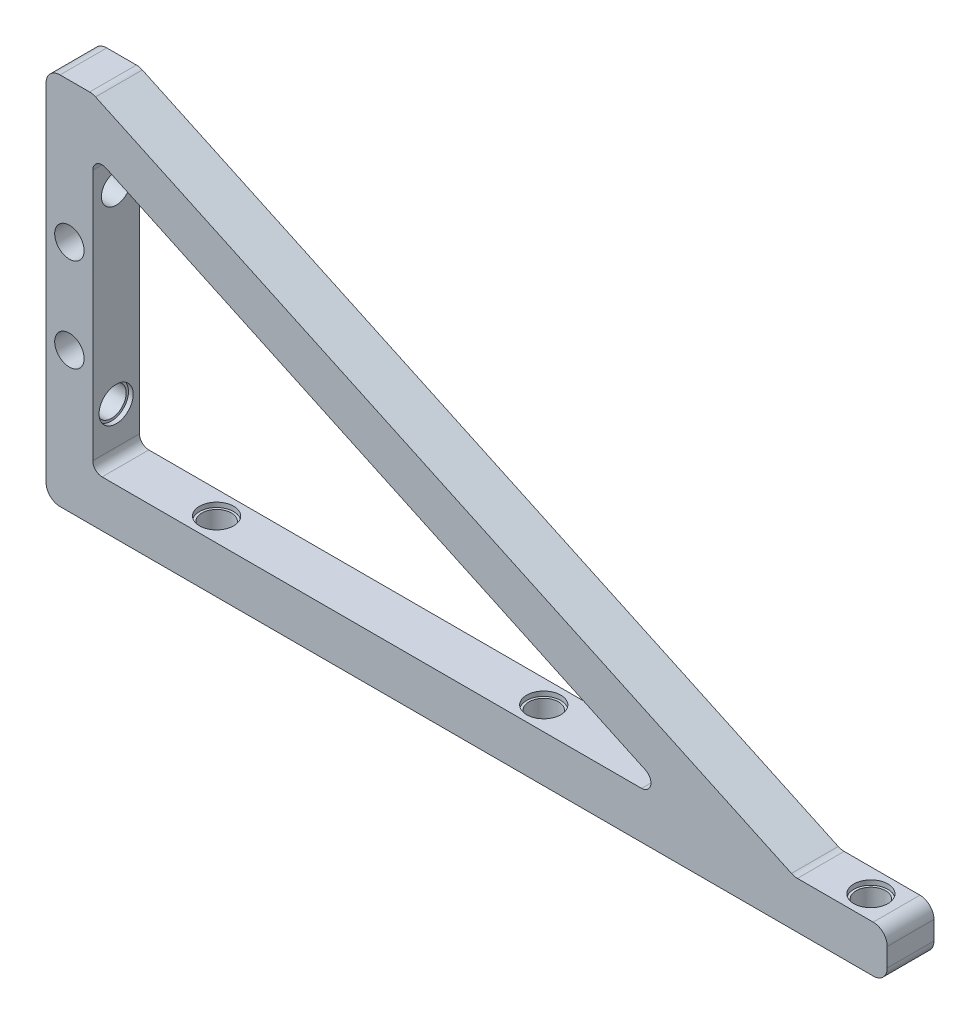
ISO-10303-21;
HEADER;
FILE_DESCRIPTION(('STEP AP214'),'2;1');
FILE_NAME('part.step','',(''),(''),'','','');
FILE_SCHEMA(('AUTOMOTIVE_DESIGN { 1 0 10303 214 1 1 1 1 }'));
ENDSEC;
DATA;
#1=APPLICATION_CONTEXT('core data for automotive mechanical design processes');
#2=APPLICATION_PROTOCOL_DEFINITION('international standard','automotive_design',2000,#1);
#3=PRODUCT_CONTEXT('',#1,'mechanical');
#4=PRODUCT('Part','Part','',(#3));
#5=PRODUCT_RELATED_PRODUCT_CATEGORY('part','',(#4));
#6=PRODUCT_DEFINITION_FORMATION('','',#4);
#7=PRODUCT_DEFINITION_CONTEXT('part definition',#1,'design');
#8=PRODUCT_DEFINITION('design','',#6,#7);
#9=PRODUCT_DEFINITION_SHAPE('','',#8);
#10=(LENGTH_UNIT() NAMED_UNIT(*) SI_UNIT(.MILLI.,.METRE.));
#11=(NAMED_UNIT(*) PLANE_ANGLE_UNIT() SI_UNIT($,.RADIAN.));
#12=(NAMED_UNIT(*) SI_UNIT($,.STERADIAN.) SOLID_ANGLE_UNIT());
#13=UNCERTAINTY_MEASURE_WITH_UNIT(LENGTH_MEASURE(1.E-05),#10,'distance_accuracy_value','');
#14=(GEOMETRIC_REPRESENTATION_CONTEXT(3) GLOBAL_UNCERTAINTY_ASSIGNED_CONTEXT((#13)) GLOBAL_UNIT_ASSIGNED_CONTEXT((#10,
#11,#12)) REPRESENTATION_CONTEXT('',''));
#15=CARTESIAN_POINT('',(0.,0.,0.));
#16=DIRECTION('',(0.,0.,1.));
#17=DIRECTION('',(1.,0.,0.));
#18=AXIS2_PLACEMENT_3D('',#15,#16,#17);
#19=CARTESIAN_POINT('',(5.,30.,0.));
#20=DIRECTION('',(0.,0.,1.));
#21=DIRECTION('',(1.,0.,0.));
#22=AXIS2_PLACEMENT_3D('',#19,#20,#21);
#23=CYLINDRICAL_SURFACE('',#22,3.15);
#24=CARTESIAN_POINT('',(5.,30.,10.));
#25=DIRECTION('',(0.,0.,-1.));
#26=DIRECTION('',(-1.,0.,0.));
#27=AXIS2_PLACEMENT_3D('',#24,#25,#26);
#28=CIRCLE('',#27,3.15);
#29=CARTESIAN_POINT('',(1.85000000000001,30.,10.));
#30=VERTEX_POINT('',#29);
#31=EDGE_CURVE('E264',#30,#30,#28,.T.);
#32=ORIENTED_EDGE('',*,*,#31,.F.);
#33=EDGE_LOOP('',(#32));
#34=FACE_BOUND('',#33,.T.);
#35=CARTESIAN_POINT('',(5.,30.,1.));
#36=DIRECTION('',(0.,0.,-1.));
#37=DIRECTION('',(-1.,0.,0.));
#38=AXIS2_PLACEMENT_3D('',#35,#36,#37);
#39=CIRCLE('',#38,3.15);
#40=CARTESIAN_POINT('',(1.85000000000001,30.,1.));
#41=VERTEX_POINT('',#40);
#42=EDGE_CURVE('E37',#41,#41,#39,.F.);
#43=ORIENTED_EDGE('',*,*,#42,.F.);
#44=EDGE_LOOP('',(#43));
#45=FACE_BOUND('',#44,.T.);
#46=ADVANCED_FACE('F33',(#34,#45),#23,.F.);
#47=CARTESIAN_POINT('',(5.,50.,0.));
#48=DIRECTION('',(0.,0.,1.));
#49=DIRECTION('',(1.,0.,0.));
#50=AXIS2_PLACEMENT_3D('',#47,#48,#49);
#51=CYLINDRICAL_SURFACE('',#50,3.15);
#52=CARTESIAN_POINT('',(5.,50.,10.));
#53=DIRECTION('',(0.,0.,-1.));
#54=DIRECTION('',(-1.,0.,0.));
#55=AXIS2_PLACEMENT_3D('',#52,#53,#54);
#56=CIRCLE('',#55,3.15);
#57=CARTESIAN_POINT('',(1.85000000000001,50.,10.));
#58=VERTEX_POINT('',#57);
#59=EDGE_CURVE('E269',#58,#58,#56,.T.);
#60=ORIENTED_EDGE('',*,*,#59,.F.);
#61=EDGE_LOOP('',(#60));
#62=FACE_BOUND('',#61,.T.);
#63=CARTESIAN_POINT('',(5.,50.,1.));
#64=DIRECTION('',(0.,0.,-1.));
#65=DIRECTION('',(-1.,0.,0.));
#66=AXIS2_PLACEMENT_3D('',#63,#64,#65);
#67=CIRCLE('',#66,3.15);
#68=CARTESIAN_POINT('',(1.85000000000001,50.,1.));
#69=VERTEX_POINT('',#68);
#70=EDGE_CURVE('E262',#69,#69,#67,.F.);
#71=ORIENTED_EDGE('',*,*,#70,.F.);
#72=EDGE_LOOP('',(#71));
#73=FACE_BOUND('',#72,.T.);
#74=ADVANCED_FACE('F457',(#62,#73),#51,.F.);
#75=CARTESIAN_POINT('',(-1.2E-05,20.,5.));
#76=DIRECTION('',(1.,0.,0.));
#77=DIRECTION('',(0.,0.,-1.));
#78=AXIS2_PLACEMENT_3D('',#75,#76,#77);
#79=CYLINDRICAL_SURFACE('',#78,3.15);
#80=CARTESIAN_POINT('',(0.,20.,5.));
#81=DIRECTION('',(1.,0.,0.));
#82=DIRECTION('',(0.,0.,-1.));
#83=AXIS2_PLACEMENT_3D('',#80,#81,#82);
#84=CIRCLE('',#83,3.15);
#85=CARTESIAN_POINT('',(0.,20.,1.85));
#86=VERTEX_POINT('',#85);
#87=EDGE_CURVE('E297',#86,#86,#84,.F.);
#88=ORIENTED_EDGE('',*,*,#87,.T.);
#89=EDGE_LOOP('',(#88));
#90=FACE_BOUND('',#89,.T.);
#91=CARTESIAN_POINT('',(9.00000000000001,20.,5.));
#92=DIRECTION('',(1.,0.,0.));
#93=DIRECTION('',(0.,0.,-1.));
#94=AXIS2_PLACEMENT_3D('',#91,#92,#93);
#95=CIRCLE('',#94,3.15);
#96=CARTESIAN_POINT('',(9.00000000000001,20.,1.85));
#97=VERTEX_POINT('',#96);
#98=EDGE_CURVE('E196',#97,#97,#95,.T.);
#99=ORIENTED_EDGE('',*,*,#98,.T.);
#100=EDGE_LOOP('',(#99));
#101=FACE_BOUND('',#100,.T.);
#102=ADVANCED_FACE('F463',(#90,#101),#79,.F.);
#103=CARTESIAN_POINT('',(-1.2E-05,60.,5.));
#104=DIRECTION('',(1.,0.,0.));
#105=DIRECTION('',(0.,0.,-1.));
#106=AXIS2_PLACEMENT_3D('',#103,#104,#105);
#107=CYLINDRICAL_SURFACE('',#106,3.15);
#108=CARTESIAN_POINT('',(10.,60.,5.));
#109=DIRECTION('',(-1.,0.,0.));
#110=DIRECTION('',(0.,0.,1.));
#111=AXIS2_PLACEMENT_3D('',#108,#109,#110);
#112=CIRCLE('',#111,3.15);
#113=CARTESIAN_POINT('',(10.,60.,8.15));
#114=VERTEX_POINT('',#113);
#115=EDGE_CURVE('E300',#114,#114,#112,.F.);
#116=ORIENTED_EDGE('',*,*,#115,.T.);
#117=EDGE_LOOP('',(#116));
#118=FACE_BOUND('',#117,.T.);
#119=CARTESIAN_POINT('',(1.,60.,5.));
#120=DIRECTION('',(-1.,0.,0.));
#121=DIRECTION('',(0.,0.,1.));
#122=AXIS2_PLACEMENT_3D('',#119,#120,#121);
#123=CIRCLE('',#122,3.15);
#124=CARTESIAN_POINT('',(1.,60.,8.15));
#125=VERTEX_POINT('',#124);
#126=EDGE_CURVE('E293',#125,#125,#123,.T.);
#127=ORIENTED_EDGE('',*,*,#126,.T.);
#128=EDGE_LOOP('',(#127));
#129=FACE_BOUND('',#128,.T.);
#130=ADVANCED_FACE('F379',(#118,#129),#107,.F.);
#131=CARTESIAN_POINT('',(171.5,-1.2E-05,5.));
#132=DIRECTION('',(0.,1.,0.));
#133=DIRECTION('',(0.,0.,1.));
#134=AXIS2_PLACEMENT_3D('',#131,#132,#133);
#135=CYLINDRICAL_SURFACE('',#134,3.14999999999998);
#136=CARTESIAN_POINT('',(171.5,0.,5.));
#137=DIRECTION('',(0.,1.,0.));
#138=DIRECTION('',(0.,0.,1.));
#139=AXIS2_PLACEMENT_3D('',#136,#137,#138);
#140=CIRCLE('',#139,3.14999999999998);
#141=CARTESIAN_POINT('',(171.5,0.,8.14999999999999));
#142=VERTEX_POINT('',#141);
#143=EDGE_CURVE('E327',#142,#142,#140,.F.);
#144=ORIENTED_EDGE('',*,*,#143,.T.);
#145=EDGE_LOOP('',(#144));
#146=FACE_BOUND('',#145,.T.);
#147=CARTESIAN_POINT('',(171.5,9.,5.));
#148=DIRECTION('',(0.,1.,0.));
#149=DIRECTION('',(0.,0.,1.));
#150=AXIS2_PLACEMENT_3D('',#147,#148,#149);
#151=CIRCLE('',#150,3.14999999999998);
#152=CARTESIAN_POINT('',(171.5,9.,8.14999999999999));
#153=VERTEX_POINT('',#152);
#154=EDGE_CURVE('E307',#153,#153,#151,.T.);
#155=ORIENTED_EDGE('',*,*,#154,.T.);
#156=EDGE_LOOP('',(#155));
#157=FACE_BOUND('',#156,.T.);
#158=ADVANCED_FACE('F483',(#146,#157),#135,.F.);
#159=CARTESIAN_POINT('',(101.5,-1.2E-05,5.));
#160=DIRECTION('',(0.,1.,0.));
#161=DIRECTION('',(0.,0.,1.));
#162=AXIS2_PLACEMENT_3D('',#159,#160,#161);
#163=CYLINDRICAL_SURFACE('',#162,3.15000000000001);
#164=CARTESIAN_POINT('',(101.5,0.,5.));
#165=DIRECTION('',(0.,1.,0.));
#166=DIRECTION('',(0.,0.,1.));
#167=AXIS2_PLACEMENT_3D('',#164,#165,#166);
#168=CIRCLE('',#167,3.15000000000001);
#169=CARTESIAN_POINT('',(101.5,0.,8.15000000000001));
#170=VERTEX_POINT('',#169);
#171=EDGE_CURVE('E328',#170,#170,#168,.F.);
#172=ORIENTED_EDGE('',*,*,#171,.T.);
#173=EDGE_LOOP('',(#172));
#174=FACE_BOUND('',#173,.T.);
#175=CARTESIAN_POINT('',(101.5,9.,5.));
#176=DIRECTION('',(0.,1.,0.));
#177=DIRECTION('',(0.,0.,1.));
#178=AXIS2_PLACEMENT_3D('',#175,#176,#177);
#179=CIRCLE('',#178,3.15000000000001);
#180=CARTESIAN_POINT('',(101.5,9.,8.15000000000001));
#181=VERTEX_POINT('',#180);
#182=EDGE_CURVE('E319',#181,#181,#179,.T.);
#183=ORIENTED_EDGE('',*,*,#182,.T.);
#184=EDGE_LOOP('',(#183));
#185=FACE_BOUND('',#184,.T.);
#186=ADVANCED_FACE('F511',(#174,#185),#163,.F.);
#187=CARTESIAN_POINT('',(10.,10.,0.));
#188=DIRECTION('',(0.,-1.,0.));
#189=DIRECTION('',(0.,0.,-1.));
#190=AXIS2_PLACEMENT_3D('',#187,#188,#189);
#191=PLANE('',#190);
#192=CARTESIAN_POINT('',(171.5,10.,5.));
#193=DIRECTION('',(0.,1.,0.));
#194=DIRECTION('',(0.,0.,1.));
#195=AXIS2_PLACEMENT_3D('',#192,#193,#194);
#196=CIRCLE('',#195,3.64999999999998);
#197=CARTESIAN_POINT('',(171.5,10.,8.64999999999998));
#198=VERTEX_POINT('',#197);
#199=EDGE_CURVE('E308',#198,#198,#196,.T.);
#200=ORIENTED_EDGE('',*,*,#199,.F.);
#201=EDGE_LOOP('',(#200));
#202=FACE_BOUND('',#201,.T.);
#203=DIRECTION('',(1.,0.,0.));
#204=VECTOR('',#203,1.);
#205=CARTESIAN_POINT('',(10.,10.,0.));
#206=LINE('',#205,#204);
#207=CARTESIAN_POINT('',(160.780568423598,10.,0.));
#208=VERTEX_POINT('',#207);
#209=CARTESIAN_POINT('',(177.,10.,0.));
#210=VERTEX_POINT('',#209);
#211=EDGE_CURVE('E344',#208,#210,#206,.T.);
#212=ORIENTED_EDGE('',*,*,#211,.F.);
#213=DIRECTION('',(0.,0.,1.));
#214=VECTOR('',#213,1.);
#215=CARTESIAN_POINT('',(160.780568423598,10.,0.));
#216=LINE('',#215,#214);
#217=CARTESIAN_POINT('',(160.780568423598,10.,10.));
#218=VERTEX_POINT('',#217);
#219=EDGE_CURVE('E217',#208,#218,#216,.T.);
#220=ORIENTED_EDGE('',*,*,#219,.T.);
#221=DIRECTION('',(-1.,0.,0.));
#222=VECTOR('',#221,1.);
#223=CARTESIAN_POINT('',(0.,10.,10.));
#224=LINE('',#223,#222);
#225=CARTESIAN_POINT('',(177.,10.,10.));
#226=VERTEX_POINT('',#225);
#227=EDGE_CURVE('E183',#226,#218,#224,.T.);
#228=ORIENTED_EDGE('',*,*,#227,.F.);
#229=DIRECTION('',(0.,0.,1.));
#230=VECTOR('',#229,1.);
#231=CARTESIAN_POINT('',(177.,10.,0.));
#232=LINE('',#231,#230);
#233=EDGE_CURVE('E215',#226,#210,#232,.F.);
#234=ORIENTED_EDGE('',*,*,#233,.T.);
#235=EDGE_LOOP('',(#212,#220,#228,#234));
#236=FACE_BOUND('',#235,.T.);
#237=ADVANCED_FACE('F399',(#202,#236),#191,.F.);
#238=CARTESIAN_POINT('',(0.,0.,10.));
#239=DIRECTION('',(1.,0.,0.));
#240=DIRECTION('',(0.,0.,-1.));
#241=AXIS2_PLACEMENT_3D('',#238,#239,#240);
#242=PLANE('',#241);
#243=CARTESIAN_POINT('',(0.,60.,5.));
#244=DIRECTION('',(-1.,0.,0.));
#245=DIRECTION('',(0.,0.,1.));
#246=AXIS2_PLACEMENT_3D('',#243,#244,#245);
#247=CIRCLE('',#246,3.65);
#248=CARTESIAN_POINT('',(0.,60.,8.65));
#249=VERTEX_POINT('',#248);
#250=EDGE_CURVE('E294',#249,#249,#247,.T.);
#251=ORIENTED_EDGE('',*,*,#250,.F.);
#252=EDGE_LOOP('',(#251));
#253=FACE_BOUND('',#252,.T.);
#254=ORIENTED_EDGE('',*,*,#87,.F.);
#255=EDGE_LOOP('',(#254));
#256=FACE_BOUND('',#255,.T.);
#257=DIRECTION('',(0.,-1.,0.));
#258=VECTOR('',#257,1.);
#259=CARTESIAN_POINT('',(0.,0.,0.));
#260=LINE('',#259,#258);
#261=CARTESIAN_POINT('',(0.,77.,0.));
#262=VERTEX_POINT('',#261);
#263=CARTESIAN_POINT('',(0.,3.,0.));
#264=VERTEX_POINT('',#263);
#265=EDGE_CURVE('E350',#262,#264,#260,.T.);
#266=ORIENTED_EDGE('',*,*,#265,.T.);
#267=DIRECTION('',(0.,0.,-1.));
#268=VECTOR('',#267,1.);
#269=CARTESIAN_POINT('',(0.,3.,10.));
#270=LINE('',#269,#268);
#271=CARTESIAN_POINT('',(0.,3.,10.));
#272=VERTEX_POINT('',#271);
#273=EDGE_CURVE('E256',#264,#272,#270,.F.);
#274=ORIENTED_EDGE('',*,*,#273,.T.);
#275=DIRECTION('',(0.,-1.,0.));
#276=VECTOR('',#275,1.);
#277=CARTESIAN_POINT('',(0.,0.,10.));
#278=LINE('',#277,#276);
#279=CARTESIAN_POINT('',(0.,77.,10.));
#280=VERTEX_POINT('',#279);
#281=EDGE_CURVE('E351',#280,#272,#278,.T.);
#282=ORIENTED_EDGE('',*,*,#281,.F.);
#283=DIRECTION('',(0.,0.,-1.));
#284=VECTOR('',#283,1.);
#285=CARTESIAN_POINT('',(0.,77.,10.));
#286=LINE('',#285,#284);
#287=EDGE_CURVE('E254',#280,#262,#286,.T.);
#288=ORIENTED_EDGE('',*,*,#287,.T.);
#289=EDGE_LOOP('',(#266,#274,#282,#288));
#290=FACE_BOUND('',#289,.T.);
#291=ADVANCED_FACE('F395',(#253,#256,#290),#242,.F.);
#292=CARTESIAN_POINT('',(0.,0.,10.));
#293=DIRECTION('',(0.,1.,0.));
#294=DIRECTION('',(0.,0.,1.));
#295=AXIS2_PLACEMENT_3D('',#292,#293,#294);
#296=PLANE('',#295);
#297=ORIENTED_EDGE('',*,*,#143,.F.);
#298=EDGE_LOOP('',(#297));
#299=FACE_BOUND('',#298,.T.);
#300=CARTESIAN_POINT('',(31.5,0.,4.99999999999998));
#301=DIRECTION('',(0.,1.,0.));
#302=DIRECTION('',(0.,0.,1.));
#303=AXIS2_PLACEMENT_3D('',#300,#301,#302);
#304=CIRCLE('',#303,3.15000000000003);
#305=CARTESIAN_POINT('',(31.5,0.,8.15000000000001));
#306=VERTEX_POINT('',#305);
#307=EDGE_CURVE('E324',#306,#306,#304,.F.);
#308=ORIENTED_EDGE('',*,*,#307,.F.);
#309=EDGE_LOOP('',(#308));
#310=FACE_BOUND('',#309,.T.);
#311=ORIENTED_EDGE('',*,*,#171,.F.);
#312=EDGE_LOOP('',(#311));
#313=FACE_BOUND('',#312,.T.);
#314=DIRECTION('',(1.,0.,0.));
#315=VECTOR('',#314,1.);
#316=CARTESIAN_POINT('',(0.,0.,0.));
#317=LINE('',#316,#315);
#318=CARTESIAN_POINT('',(3.,0.,0.));
#319=VERTEX_POINT('',#318);
#320=CARTESIAN_POINT('',(177.,0.,0.));
#321=VERTEX_POINT('',#320);
#322=EDGE_CURVE('E361',#319,#321,#317,.T.);
#323=ORIENTED_EDGE('',*,*,#322,.T.);
#324=DIRECTION('',(0.,0.,-1.));
#325=VECTOR('',#324,1.);
#326=CARTESIAN_POINT('',(177.,0.,10.));
#327=LINE('',#326,#325);
#328=CARTESIAN_POINT('',(177.,0.,10.));
#329=VERTEX_POINT('',#328);
#330=EDGE_CURVE('E252',#321,#329,#327,.F.);
#331=ORIENTED_EDGE('',*,*,#330,.T.);
#332=DIRECTION('',(1.,0.,0.));
#333=VECTOR('',#332,1.);
#334=CARTESIAN_POINT('',(0.,0.,10.));
#335=LINE('',#334,#333);
#336=CARTESIAN_POINT('',(3.,0.,10.));
#337=VERTEX_POINT('',#336);
#338=EDGE_CURVE('E354',#337,#329,#335,.T.);
#339=ORIENTED_EDGE('',*,*,#338,.F.);
#340=DIRECTION('',(0.,0.,-1.));
#341=VECTOR('',#340,1.);
#342=CARTESIAN_POINT('',(3.,0.,10.));
#343=LINE('',#342,#341);
#344=EDGE_CURVE('E249',#337,#319,#343,.T.);
#345=ORIENTED_EDGE('',*,*,#344,.T.);
#346=EDGE_LOOP('',(#323,#331,#339,#345));
#347=FACE_BOUND('',#346,.T.);
#348=ADVANCED_FACE('F398',(#299,#310,#313,#347),#296,.F.);
#349=CARTESIAN_POINT('',(180.,0.,10.));
#350=DIRECTION('',(-1.,0.,0.));
#351=DIRECTION('',(0.,0.,1.));
#352=AXIS2_PLACEMENT_3D('',#349,#350,#351);
#353=PLANE('',#352);
#354=DIRECTION('',(0.,1.,0.));
#355=VECTOR('',#354,1.);
#356=CARTESIAN_POINT('',(180.,0.,0.));
#357=LINE('',#356,#355);
#358=CARTESIAN_POINT('',(180.,3.,0.));
#359=VERTEX_POINT('',#358);
#360=CARTESIAN_POINT('',(180.,7.,0.));
#361=VERTEX_POINT('',#360);
#362=EDGE_CURVE('E364',#359,#361,#357,.T.);
#363=ORIENTED_EDGE('',*,*,#362,.T.);
#364=DIRECTION('',(0.,0.,1.));
#365=VECTOR('',#364,1.);
#366=CARTESIAN_POINT('',(180.,7.,10.));
#367=LINE('',#366,#365);
#368=CARTESIAN_POINT('',(180.,7.,10.));
#369=VERTEX_POINT('',#368);
#370=EDGE_CURVE('E228',#361,#369,#367,.T.);
#371=ORIENTED_EDGE('',*,*,#370,.T.);
#372=DIRECTION('',(0.,1.,0.));
#373=VECTOR('',#372,1.);
#374=CARTESIAN_POINT('',(180.,0.,10.));
#375=LINE('',#374,#373);
#376=CARTESIAN_POINT('',(180.,3.,10.));
#377=VERTEX_POINT('',#376);
#378=EDGE_CURVE('E193',#377,#369,#375,.T.);
#379=ORIENTED_EDGE('',*,*,#378,.F.);
#380=DIRECTION('',(0.,0.,-1.));
#381=VECTOR('',#380,1.);
#382=CARTESIAN_POINT('',(180.,3.,10.));
#383=LINE('',#382,#381);
#384=EDGE_CURVE('E225',#377,#359,#383,.T.);
#385=ORIENTED_EDGE('',*,*,#384,.T.);
#386=EDGE_LOOP('',(#363,#371,#379,#385));
#387=FACE_BOUND('',#386,.T.);
#388=ADVANCED_FACE('F418',(#387),#353,.F.);
#389=CARTESIAN_POINT('',(0.,80.,10.));
#390=DIRECTION('',(0.,-1.,0.));
#391=DIRECTION('',(0.,0.,-1.));
#392=AXIS2_PLACEMENT_3D('',#389,#390,#391);
#393=PLANE('',#392);
#394=DIRECTION('',(-1.,0.,0.));
#395=VECTOR('',#394,1.);
#396=CARTESIAN_POINT('',(0.,80.,10.));
#397=LINE('',#396,#395);
#398=CARTESIAN_POINT('',(9.3349160120712,80.,10.));
#399=VERTEX_POINT('',#398);
#400=CARTESIAN_POINT('',(3.,80.,10.));
#401=VERTEX_POINT('',#400);
#402=EDGE_CURVE('E188',#399,#401,#397,.T.);
#403=ORIENTED_EDGE('',*,*,#402,.F.);
#404=DIRECTION('',(0.,0.,1.));
#405=VECTOR('',#404,1.);
#406=CARTESIAN_POINT('',(9.3349160120712,80.,0.));
#407=LINE('',#406,#405);
#408=CARTESIAN_POINT('',(9.3349160120712,80.,0.));
#409=VERTEX_POINT('',#408);
#410=EDGE_CURVE('E260',#399,#409,#407,.F.);
#411=ORIENTED_EDGE('',*,*,#410,.T.);
#412=DIRECTION('',(-1.,0.,0.));
#413=VECTOR('',#412,1.);
#414=CARTESIAN_POINT('',(0.,80.,0.));
#415=LINE('',#414,#413);
#416=CARTESIAN_POINT('',(3.,80.,0.));
#417=VERTEX_POINT('',#416);
#418=EDGE_CURVE('E355',#409,#417,#415,.T.);
#419=ORIENTED_EDGE('',*,*,#418,.T.);
#420=DIRECTION('',(0.,0.,-1.));
#421=VECTOR('',#420,1.);
#422=CARTESIAN_POINT('',(3.,80.,10.));
#423=LINE('',#422,#421);
#424=EDGE_CURVE('E258',#417,#401,#423,.F.);
#425=ORIENTED_EDGE('',*,*,#424,.T.);
#426=EDGE_LOOP('',(#403,#411,#419,#425));
#427=FACE_BOUND('',#426,.T.);
#428=ADVANCED_FACE('F446',(#427),#393,.F.);
#429=CARTESIAN_POINT('',(0.,0.,10.));
#430=DIRECTION('',(0.,0.,-1.));
#431=DIRECTION('',(-1.,0.,0.));
#432=AXIS2_PLACEMENT_3D('',#429,#430,#431);
#433=PLANE('',#432);
#434=ORIENTED_EDGE('',*,*,#31,.T.);
#435=EDGE_LOOP('',(#434));
#436=FACE_BOUND('',#435,.T.);
#437=ORIENTED_EDGE('',*,*,#59,.T.);
#438=EDGE_LOOP('',(#437));
#439=FACE_BOUND('',#438,.T.);
#440=CARTESIAN_POINT('',(127.43205159682,10.,10.));
#441=VERTEX_POINT('',#440);
#442=CARTESIAN_POINT('',(12.,10.,10.));
#443=VERTEX_POINT('',#442);
#444=EDGE_CURVE('E165',#441,#443,#224,.T.);
#445=ORIENTED_EDGE('',*,*,#444,.T.);
#446=CARTESIAN_POINT('',(12.,12.,10.));
#447=DIRECTION('',(0.,0.,-1.));
#448=DIRECTION('',(-1.,0.,0.));
#449=AXIS2_PLACEMENT_3D('',#446,#447,#448);
#450=CIRCLE('',#449,2.);
#451=CARTESIAN_POINT('',(10.,12.,10.));
#452=VERTEX_POINT('',#451);
#453=EDGE_CURVE('E207',#443,#452,#450,.T.);
#454=ORIENTED_EDGE('',*,*,#453,.T.);
#455=DIRECTION('',(0.,1.,0.));
#456=VECTOR('',#455,1.);
#457=CARTESIAN_POINT('',(10.,0.,10.));
#458=LINE('',#457,#456);
#459=CARTESIAN_POINT('',(10.,65.8268496561401,10.));
#460=VERTEX_POINT('',#459);
#461=EDGE_CURVE('E347',#452,#460,#458,.T.);
#462=ORIENTED_EDGE('',*,*,#461,.T.);
#463=CARTESIAN_POINT('',(12.,65.8268496561401,10.));
#464=DIRECTION('',(0.,0.,-1.));
#465=DIRECTION('',(-1.,0.,0.));
#466=AXIS2_PLACEMENT_3D('',#463,#464,#465);
#467=CIRCLE('',#466,2.);
#468=CARTESIAN_POINT('',(12.8452365234814,67.6394652302134,10.));
#469=VERTEX_POINT('',#468);
#470=EDGE_CURVE('E211',#460,#469,#467,.T.);
#471=ORIENTED_EDGE('',*,*,#470,.T.);
#472=DIRECTION('',(0.90630778703665,-0.4226182617407,0.));
#473=VECTOR('',#472,1.);
#474=CARTESIAN_POINT('',(136.453468604144,10.,10.));
#475=LINE('',#474,#473);
#476=CARTESIAN_POINT('',(128.277288120301,13.8126155740733,10.));
#477=VERTEX_POINT('',#476);
#478=EDGE_CURVE('E167',#469,#477,#475,.T.);
#479=ORIENTED_EDGE('',*,*,#478,.T.);
#480=CARTESIAN_POINT('',(127.43205159682,12.,10.));
#481=DIRECTION('',(0.,0.,-1.));
#482=DIRECTION('',(-1.,0.,0.));
#483=AXIS2_PLACEMENT_3D('',#480,#481,#482);
#484=CIRCLE('',#483,2.);
#485=EDGE_CURVE('E161',#477,#441,#484,.T.);
#486=ORIENTED_EDGE('',*,*,#485,.T.);
#487=EDGE_LOOP('',(#445,#454,#462,#471,#479,#486));
#488=FACE_BOUND('',#487,.T.);
#489=ORIENTED_EDGE('',*,*,#378,.T.);
#490=CARTESIAN_POINT('',(177.,7.,10.));
#491=DIRECTION('',(0.,0.,-1.));
#492=DIRECTION('',(-1.,0.,0.));
#493=AXIS2_PLACEMENT_3D('',#490,#491,#492);
#494=CIRCLE('',#493,3.);
#495=EDGE_CURVE('E239',#369,#226,#494,.F.);
#496=ORIENTED_EDGE('',*,*,#495,.T.);
#497=ORIENTED_EDGE('',*,*,#227,.T.);
#498=CARTESIAN_POINT('',(160.780568423598,13.,10.));
#499=DIRECTION('',(0.,0.,-1.));
#500=DIRECTION('',(-1.,0.,0.));
#501=AXIS2_PLACEMENT_3D('',#498,#499,#500);
#502=CIRCLE('',#501,3.);
#503=CARTESIAN_POINT('',(159.512713638375,10.2810766388901,10.));
#504=VERTEX_POINT('',#503);
#505=EDGE_CURVE('E42',#218,#504,#502,.T.);
#506=ORIENTED_EDGE('',*,*,#505,.T.);
#507=DIRECTION('',(-0.90630778703665,0.4226182617407,0.));
#508=VECTOR('',#507,1.);
#509=CARTESIAN_POINT('',(10.,80.,10.));
#510=LINE('',#509,#508);
#511=CARTESIAN_POINT('',(10.6027707972933,79.7189233611099,10.));
#512=VERTEX_POINT('',#511);
#513=EDGE_CURVE('E335',#504,#512,#510,.T.);
#514=ORIENTED_EDGE('',*,*,#513,.T.);
#515=CARTESIAN_POINT('',(9.3349160120712,77.,10.));
#516=DIRECTION('',(0.,0.,-1.));
#517=DIRECTION('',(-1.,0.,0.));
#518=AXIS2_PLACEMENT_3D('',#515,#516,#517);
#519=CIRCLE('',#518,3.);
#520=EDGE_CURVE('E233',#512,#399,#519,.F.);
#521=ORIENTED_EDGE('',*,*,#520,.T.);
#522=ORIENTED_EDGE('',*,*,#402,.T.);
#523=CARTESIAN_POINT('',(3.,77.,10.));
#524=DIRECTION('',(0.,0.,-1.));
#525=DIRECTION('',(-1.,0.,0.));
#526=AXIS2_PLACEMENT_3D('',#523,#524,#525);
#527=CIRCLE('',#526,3.);
#528=EDGE_CURVE('E231',#401,#280,#527,.F.);
#529=ORIENTED_EDGE('',*,*,#528,.T.);
#530=ORIENTED_EDGE('',*,*,#281,.T.);
#531=CARTESIAN_POINT('',(3.,3.,10.));
#532=DIRECTION('',(0.,0.,-1.));
#533=DIRECTION('',(-1.,0.,0.));
#534=AXIS2_PLACEMENT_3D('',#531,#532,#533);
#535=CIRCLE('',#534,3.);
#536=EDGE_CURVE('E235',#272,#337,#535,.F.);
#537=ORIENTED_EDGE('',*,*,#536,.T.);
#538=ORIENTED_EDGE('',*,*,#338,.T.);
#539=CARTESIAN_POINT('',(177.,3.,10.));
#540=DIRECTION('',(0.,0.,-1.));
#541=DIRECTION('',(-1.,0.,0.));
#542=AXIS2_PLACEMENT_3D('',#539,#540,#541);
#543=CIRCLE('',#542,3.);
#544=EDGE_CURVE('E237',#329,#377,#543,.F.);
#545=ORIENTED_EDGE('',*,*,#544,.T.);
#546=EDGE_LOOP('',(#489,#496,#497,#506,#514,#521,#522,#529,#530,#537,#538,#545));
#547=FACE_BOUND('',#546,.T.);
#548=ADVANCED_FACE('F163',(#436,#439,#488,#547),#433,.F.);
#549=CARTESIAN_POINT('',(0.,0.,0.));
#550=DIRECTION('',(0.,0.,-1.));
#551=DIRECTION('',(-1.,0.,0.));
#552=AXIS2_PLACEMENT_3D('',#549,#550,#551);
#553=PLANE('',#552);
#554=CARTESIAN_POINT('',(5.,30.,0.));
#555=DIRECTION('',(0.,0.,-1.));
#556=DIRECTION('',(-1.,0.,0.));
#557=AXIS2_PLACEMENT_3D('',#554,#555,#556);
#558=CIRCLE('',#557,3.65);
#559=CARTESIAN_POINT('',(1.35,30.,0.));
#560=VERTEX_POINT('',#559);
#561=EDGE_CURVE('E279',#560,#560,#558,.T.);
#562=ORIENTED_EDGE('',*,*,#561,.F.);
#563=EDGE_LOOP('',(#562));
#564=FACE_BOUND('',#563,.T.);
#565=CARTESIAN_POINT('',(5.,50.,0.));
#566=DIRECTION('',(0.,0.,-1.));
#567=DIRECTION('',(-1.,0.,0.));
#568=AXIS2_PLACEMENT_3D('',#565,#566,#567);
#569=CIRCLE('',#568,3.65);
#570=CARTESIAN_POINT('',(1.35,50.,0.));
#571=VERTEX_POINT('',#570);
#572=EDGE_CURVE('E272',#571,#571,#569,.T.);
#573=ORIENTED_EDGE('',*,*,#572,.F.);
#574=EDGE_LOOP('',(#573));
#575=FACE_BOUND('',#574,.T.);
#576=DIRECTION('',(0.90630778703665,-0.4226182617407,0.));
#577=VECTOR('',#576,1.);
#578=CARTESIAN_POINT('',(136.453468604144,10.,0.));
#579=LINE('',#578,#577);
#580=CARTESIAN_POINT('',(12.8452365234814,67.6394652302134,0.));
#581=VERTEX_POINT('',#580);
#582=CARTESIAN_POINT('',(128.277288120301,13.8126155740733,0.));
#583=VERTEX_POINT('',#582);
#584=EDGE_CURVE('E331',#581,#583,#579,.T.);
#585=ORIENTED_EDGE('',*,*,#584,.F.);
#586=CARTESIAN_POINT('',(12.,65.8268496561401,0.));
#587=DIRECTION('',(0.,0.,-1.));
#588=DIRECTION('',(-1.,0.,0.));
#589=AXIS2_PLACEMENT_3D('',#586,#587,#588);
#590=CIRCLE('',#589,2.);
#591=CARTESIAN_POINT('',(10.,65.8268496561401,0.));
#592=VERTEX_POINT('',#591);
#593=EDGE_CURVE('E213',#581,#592,#590,.F.);
#594=ORIENTED_EDGE('',*,*,#593,.T.);
#595=DIRECTION('',(0.,-1.,0.));
#596=VECTOR('',#595,1.);
#597=CARTESIAN_POINT('',(10.,80.,0.));
#598=LINE('',#597,#596);
#599=CARTESIAN_POINT('',(10.,12.,0.));
#600=VERTEX_POINT('',#599);
#601=EDGE_CURVE('E338',#592,#600,#598,.T.);
#602=ORIENTED_EDGE('',*,*,#601,.T.);
#603=CARTESIAN_POINT('',(12.,12.,0.));
#604=DIRECTION('',(0.,0.,-1.));
#605=DIRECTION('',(-1.,0.,0.));
#606=AXIS2_PLACEMENT_3D('',#603,#604,#605);
#607=CIRCLE('',#606,2.);
#608=CARTESIAN_POINT('',(12.,10.,0.));
#609=VERTEX_POINT('',#608);
#610=EDGE_CURVE('E173',#600,#609,#607,.F.);
#611=ORIENTED_EDGE('',*,*,#610,.T.);
#612=CARTESIAN_POINT('',(127.43205159682,10.,0.));
#613=VERTEX_POINT('',#612);
#614=EDGE_CURVE('E184',#609,#613,#206,.T.);
#615=ORIENTED_EDGE('',*,*,#614,.T.);
#616=CARTESIAN_POINT('',(127.43205159682,12.,0.));
#617=DIRECTION('',(0.,0.,-1.));
#618=DIRECTION('',(-1.,0.,0.));
#619=AXIS2_PLACEMENT_3D('',#616,#617,#618);
#620=CIRCLE('',#619,2.);
#621=EDGE_CURVE('E172',#613,#583,#620,.F.);
#622=ORIENTED_EDGE('',*,*,#621,.T.);
#623=EDGE_LOOP('',(#585,#594,#602,#611,#615,#622));
#624=FACE_BOUND('',#623,.T.);
#625=ORIENTED_EDGE('',*,*,#211,.T.);
#626=CARTESIAN_POINT('',(177.,7.,0.));
#627=DIRECTION('',(0.,0.,-1.));
#628=DIRECTION('',(-1.,0.,0.));
#629=AXIS2_PLACEMENT_3D('',#626,#627,#628);
#630=CIRCLE('',#629,3.);
#631=EDGE_CURVE('E247',#210,#361,#630,.T.);
#632=ORIENTED_EDGE('',*,*,#631,.T.);
#633=ORIENTED_EDGE('',*,*,#362,.F.);
#634=CARTESIAN_POINT('',(177.,3.,0.));
#635=DIRECTION('',(0.,0.,-1.));
#636=DIRECTION('',(-1.,0.,0.));
#637=AXIS2_PLACEMENT_3D('',#634,#635,#636);
#638=CIRCLE('',#637,3.);
#639=EDGE_CURVE('E245',#359,#321,#638,.T.);
#640=ORIENTED_EDGE('',*,*,#639,.T.);
#641=ORIENTED_EDGE('',*,*,#322,.F.);
#642=CARTESIAN_POINT('',(3.,3.,0.));
#643=DIRECTION('',(0.,0.,-1.));
#644=DIRECTION('',(-1.,0.,0.));
#645=AXIS2_PLACEMENT_3D('',#642,#643,#644);
#646=CIRCLE('',#645,3.);
#647=EDGE_CURVE('E50',#319,#264,#646,.T.);
#648=ORIENTED_EDGE('',*,*,#647,.T.);
#649=ORIENTED_EDGE('',*,*,#265,.F.);
#650=CARTESIAN_POINT('',(3.,77.,0.));
#651=DIRECTION('',(0.,0.,-1.));
#652=DIRECTION('',(-1.,0.,0.));
#653=AXIS2_PLACEMENT_3D('',#650,#651,#652);
#654=CIRCLE('',#653,3.);
#655=EDGE_CURVE('E58',#262,#417,#654,.T.);
#656=ORIENTED_EDGE('',*,*,#655,.T.);
#657=ORIENTED_EDGE('',*,*,#418,.F.);
#658=CARTESIAN_POINT('',(9.3349160120712,77.,0.));
#659=DIRECTION('',(0.,0.,-1.));
#660=DIRECTION('',(-1.,0.,0.));
#661=AXIS2_PLACEMENT_3D('',#658,#659,#660);
#662=CIRCLE('',#661,3.);
#663=CARTESIAN_POINT('',(10.6027707972933,79.7189233611099,0.));
#664=VERTEX_POINT('',#663);
#665=EDGE_CURVE('E242',#409,#664,#662,.T.);
#666=ORIENTED_EDGE('',*,*,#665,.T.);
#667=DIRECTION('',(-0.90630778703665,0.4226182617407,0.));
#668=VECTOR('',#667,1.);
#669=CARTESIAN_POINT('',(10.,80.,0.));
#670=LINE('',#669,#668);
#671=CARTESIAN_POINT('',(159.512713638375,10.2810766388901,0.));
#672=VERTEX_POINT('',#671);
#673=EDGE_CURVE('E334',#672,#664,#670,.T.);
#674=ORIENTED_EDGE('',*,*,#673,.F.);
#675=CARTESIAN_POINT('',(160.780568423598,13.,0.));
#676=DIRECTION('',(0.,0.,-1.));
#677=DIRECTION('',(-1.,0.,0.));
#678=AXIS2_PLACEMENT_3D('',#675,#676,#677);
#679=CIRCLE('',#678,3.);
#680=EDGE_CURVE('E11',#672,#208,#679,.F.);
#681=ORIENTED_EDGE('',*,*,#680,.T.);
#682=EDGE_LOOP('',(#625,#632,#633,#640,#641,#648,#649,#656,#657,#666,#674,#681));
#683=FACE_BOUND('',#682,.T.);
#684=ADVANCED_FACE('F531',(#564,#575,#624,#683),#553,.T.);
#685=CARTESIAN_POINT('',(10.,80.,0.));
#686=DIRECTION('',(-1.,0.,0.));
#687=DIRECTION('',(0.,0.,1.));
#688=AXIS2_PLACEMENT_3D('',#685,#686,#687);
#689=PLANE('',#688);
#690=CARTESIAN_POINT('',(10.,20.,5.));
#691=DIRECTION('',(1.,0.,0.));
#692=DIRECTION('',(0.,0.,-1.));
#693=AXIS2_PLACEMENT_3D('',#690,#691,#692);
#694=CIRCLE('',#693,3.65);
#695=CARTESIAN_POINT('',(10.,20.,1.35));
#696=VERTEX_POINT('',#695);
#697=EDGE_CURVE('E284',#696,#696,#694,.T.);
#698=ORIENTED_EDGE('',*,*,#697,.F.);
#699=EDGE_LOOP('',(#698));
#700=FACE_BOUND('',#699,.T.);
#701=ORIENTED_EDGE('',*,*,#115,.F.);
#702=EDGE_LOOP('',(#701));
#703=FACE_BOUND('',#702,.T.);
#704=ORIENTED_EDGE('',*,*,#461,.F.);
#705=DIRECTION('',(0.,0.,1.));
#706=VECTOR('',#705,1.);
#707=CARTESIAN_POINT('',(10.,12.,0.));
#708=LINE('',#707,#706);
#709=EDGE_CURVE('E201',#452,#600,#708,.F.);
#710=ORIENTED_EDGE('',*,*,#709,.T.);
#711=ORIENTED_EDGE('',*,*,#601,.F.);
#712=DIRECTION('',(0.,0.,1.));
#713=VECTOR('',#712,1.);
#714=CARTESIAN_POINT('',(10.,65.8268496561401,0.));
#715=LINE('',#714,#713);
#716=EDGE_CURVE('E190',#592,#460,#715,.T.);
#717=ORIENTED_EDGE('',*,*,#716,.T.);
#718=EDGE_LOOP('',(#704,#710,#711,#717));
#719=FACE_BOUND('',#718,.T.);
#720=ADVANCED_FACE('F527',(#700,#703,#719),#689,.F.);
#721=CARTESIAN_POINT('',(31.5,10.,5.00000000000002));
#722=DIRECTION('',(0.,1.,0.));
#723=DIRECTION('',(0.,0.,-1.));
#724=AXIS2_PLACEMENT_3D('',#721,#722,#723);
#725=CIRCLE('',#724,3.64999999999998);
#726=CARTESIAN_POINT('',(31.5,10.,1.35000000000003));
#727=VERTEX_POINT('',#726);
#728=EDGE_CURVE('E303',#727,#727,#725,.T.);
#729=ORIENTED_EDGE('',*,*,#728,.F.);
#730=EDGE_LOOP('',(#729));
#731=FACE_BOUND('',#730,.T.);
#732=CARTESIAN_POINT('',(101.5,10.,5.));
#733=DIRECTION('',(0.,1.,0.));
#734=DIRECTION('',(0.,0.,1.));
#735=AXIS2_PLACEMENT_3D('',#732,#733,#734);
#736=CIRCLE('',#735,3.65);
#737=CARTESIAN_POINT('',(101.5,10.,8.65));
#738=VERTEX_POINT('',#737);
#739=EDGE_CURVE('E320',#738,#738,#736,.T.);
#740=ORIENTED_EDGE('',*,*,#739,.F.);
#741=EDGE_LOOP('',(#740));
#742=FACE_BOUND('',#741,.T.);
#743=ORIENTED_EDGE('',*,*,#614,.F.);
#744=DIRECTION('',(0.,0.,1.));
#745=VECTOR('',#744,1.);
#746=CARTESIAN_POINT('',(12.,10.,10.));
#747=LINE('',#746,#745);
#748=EDGE_CURVE('E182',#609,#443,#747,.T.);
#749=ORIENTED_EDGE('',*,*,#748,.T.);
#750=ORIENTED_EDGE('',*,*,#444,.F.);
#751=DIRECTION('',(0.,0.,1.));
#752=VECTOR('',#751,1.);
#753=CARTESIAN_POINT('',(127.43205159682,10.,0.));
#754=LINE('',#753,#752);
#755=EDGE_CURVE('E179',#441,#613,#754,.F.);
#756=ORIENTED_EDGE('',*,*,#755,.T.);
#757=EDGE_LOOP('',(#743,#749,#750,#756));
#758=FACE_BOUND('',#757,.T.);
#759=ADVANCED_FACE('F178',(#731,#742,#758),#191,.F.);
#760=CARTESIAN_POINT('',(10.,80.,0.));
#761=DIRECTION('',(0.4226182617407,0.90630778703665,0.));
#762=DIRECTION('',(-0.90630778703665,0.4226182617407,0.));
#763=AXIS2_PLACEMENT_3D('',#760,#761,#762);
#764=PLANE('',#763);
#765=ORIENTED_EDGE('',*,*,#513,.F.);
#766=DIRECTION('',(0.,0.,1.));
#767=VECTOR('',#766,1.);
#768=CARTESIAN_POINT('',(159.512713638376,10.2810766388901,0.));
#769=LINE('',#768,#767);
#770=EDGE_CURVE('E223',#504,#672,#769,.F.);
#771=ORIENTED_EDGE('',*,*,#770,.T.);
#772=ORIENTED_EDGE('',*,*,#673,.T.);
#773=DIRECTION('',(0.,0.,1.));
#774=VECTOR('',#773,1.);
#775=CARTESIAN_POINT('',(10.6027707972933,79.7189233611099,10.));
#776=LINE('',#775,#774);
#777=EDGE_CURVE('E220',#664,#512,#776,.T.);
#778=ORIENTED_EDGE('',*,*,#777,.T.);
#779=EDGE_LOOP('',(#765,#771,#772,#778));
#780=FACE_BOUND('',#779,.T.);
#781=ADVANCED_FACE('F436',(#780),#764,.T.);
#782=CARTESIAN_POINT('',(136.453468604144,10.,0.));
#783=DIRECTION('',(-0.4226182617407,-0.90630778703665,0.));
#784=DIRECTION('',(0.90630778703665,-0.4226182617407,0.));
#785=AXIS2_PLACEMENT_3D('',#782,#783,#784);
#786=PLANE('',#785);
#787=ORIENTED_EDGE('',*,*,#584,.T.);
#788=DIRECTION('',(0.,0.,1.));
#789=VECTOR('',#788,1.);
#790=CARTESIAN_POINT('',(128.277288120301,13.8126155740733,0.));
#791=LINE('',#790,#789);
#792=EDGE_CURVE('E205',#583,#477,#791,.T.);
#793=ORIENTED_EDGE('',*,*,#792,.T.);
#794=ORIENTED_EDGE('',*,*,#478,.F.);
#795=DIRECTION('',(0.,0.,1.));
#796=VECTOR('',#795,1.);
#797=CARTESIAN_POINT('',(12.8452365234814,67.6394652302134,0.));
#798=LINE('',#797,#796);
#799=EDGE_CURVE('E203',#469,#581,#798,.F.);
#800=ORIENTED_EDGE('',*,*,#799,.T.);
#801=EDGE_LOOP('',(#787,#793,#794,#800));
#802=FACE_BOUND('',#801,.T.);
#803=ADVANCED_FACE('F515',(#802),#786,.T.);
#804=CARTESIAN_POINT('',(31.5,-1.2E-05,4.99999999999998));
#805=DIRECTION('',(0.,1.,0.));
#806=DIRECTION('',(0.,0.,1.));
#807=AXIS2_PLACEMENT_3D('',#804,#805,#806);
#808=CYLINDRICAL_SURFACE('',#807,3.15000000000003);
#809=CARTESIAN_POINT('',(31.5,9.,4.99999999999998));
#810=DIRECTION('',(0.,-1.,0.));
#811=DIRECTION('',(0.,0.,-1.));
#812=AXIS2_PLACEMENT_3D('',#809,#810,#811);
#813=CIRCLE('',#812,3.15000000000003);
#814=CARTESIAN_POINT('',(31.5,9.,1.84999999999995));
#815=VERTEX_POINT('',#814);
#816=EDGE_CURVE('E323',#815,#815,#813,.T.);
#817=ORIENTED_EDGE('',*,*,#816,.F.);
#818=EDGE_LOOP('',(#817));
#819=FACE_BOUND('',#818,.T.);
#820=ORIENTED_EDGE('',*,*,#307,.T.);
#821=EDGE_LOOP('',(#820));
#822=FACE_BOUND('',#821,.T.);
#823=ADVANCED_FACE('F507',(#819,#822),#808,.F.);
#824=CARTESIAN_POINT('',(101.5,9.,5.));
#825=DIRECTION('',(0.,1.,0.));
#826=DIRECTION('',(0.,0.,1.));
#827=AXIS2_PLACEMENT_3D('',#824,#825,#826);
#828=CYLINDRICAL_SURFACE('',#827,3.65);
#829=CARTESIAN_POINT('',(101.5,9.,5.));
#830=DIRECTION('',(0.,1.,0.));
#831=DIRECTION('',(0.,0.,1.));
#832=AXIS2_PLACEMENT_3D('',#829,#830,#831);
#833=CIRCLE('',#832,3.65);
#834=CARTESIAN_POINT('',(101.5,9.,8.65));
#835=VERTEX_POINT('',#834);
#836=EDGE_CURVE('E316',#835,#835,#833,.T.);
#837=ORIENTED_EDGE('',*,*,#836,.F.);
#838=EDGE_LOOP('',(#837));
#839=FACE_BOUND('',#838,.T.);
#840=ORIENTED_EDGE('',*,*,#739,.T.);
#841=EDGE_LOOP('',(#840));
#842=FACE_BOUND('',#841,.T.);
#843=ADVANCED_FACE('F503',(#839,#842),#828,.F.);
#844=CARTESIAN_POINT('',(101.5,9.,5.));
#845=DIRECTION('',(0.,1.,0.));
#846=DIRECTION('',(0.,0.,1.));
#847=AXIS2_PLACEMENT_3D('',#844,#845,#846);
#848=PLANE('',#847);
#849=ORIENTED_EDGE('',*,*,#182,.F.);
#850=EDGE_LOOP('',(#849));
#851=FACE_BOUND('',#850,.T.);
#852=ORIENTED_EDGE('',*,*,#836,.T.);
#853=EDGE_LOOP('',(#852));
#854=FACE_BOUND('',#853,.T.);
#855=ADVANCED_FACE('F493',(#851,#854),#848,.T.);
#856=CARTESIAN_POINT('',(171.5,9.,5.));
#857=DIRECTION('',(0.,1.,0.));
#858=DIRECTION('',(0.,0.,1.));
#859=AXIS2_PLACEMENT_3D('',#856,#857,#858);
#860=CYLINDRICAL_SURFACE('',#859,3.64999999999998);
#861=CARTESIAN_POINT('',(171.5,9.,5.));
#862=DIRECTION('',(0.,1.,0.));
#863=DIRECTION('',(0.,0.,1.));
#864=AXIS2_PLACEMENT_3D('',#861,#862,#863);
#865=CIRCLE('',#864,3.64999999999998);
#866=CARTESIAN_POINT('',(171.5,9.,8.64999999999998));
#867=VERTEX_POINT('',#866);
#868=EDGE_CURVE('E304',#867,#867,#865,.T.);
#869=ORIENTED_EDGE('',*,*,#868,.F.);
#870=EDGE_LOOP('',(#869));
#871=FACE_BOUND('',#870,.T.);
#872=ORIENTED_EDGE('',*,*,#199,.T.);
#873=EDGE_LOOP('',(#872));
#874=FACE_BOUND('',#873,.T.);
#875=ADVANCED_FACE('F489',(#871,#874),#860,.F.);
#876=CARTESIAN_POINT('',(171.5,9.,5.));
#877=DIRECTION('',(0.,1.,0.));
#878=DIRECTION('',(0.,0.,1.));
#879=AXIS2_PLACEMENT_3D('',#876,#877,#878);
#880=PLANE('',#879);
#881=ORIENTED_EDGE('',*,*,#154,.F.);
#882=EDGE_LOOP('',(#881));
#883=FACE_BOUND('',#882,.T.);
#884=ORIENTED_EDGE('',*,*,#868,.T.);
#885=EDGE_LOOP('',(#884));
#886=FACE_BOUND('',#885,.T.);
#887=ADVANCED_FACE('F485',(#883,#886),#880,.T.);
#888=CARTESIAN_POINT('',(31.5,9.,5.00000000000002));
#889=DIRECTION('',(0.,1.,0.));
#890=DIRECTION('',(0.,0.,1.));
#891=AXIS2_PLACEMENT_3D('',#888,#889,#890);
#892=CYLINDRICAL_SURFACE('',#891,3.64999999999998);
#893=CARTESIAN_POINT('',(31.5,9.,5.00000000000002));
#894=DIRECTION('',(0.,1.,0.));
#895=DIRECTION('',(0.,0.,-1.));
#896=AXIS2_PLACEMENT_3D('',#893,#894,#895);
#897=CIRCLE('',#896,3.64999999999998);
#898=CARTESIAN_POINT('',(31.5,9.,1.35000000000003));
#899=VERTEX_POINT('',#898);
#900=EDGE_CURVE('E311',#899,#899,#897,.T.);
#901=ORIENTED_EDGE('',*,*,#900,.F.);
#902=EDGE_LOOP('',(#901));
#903=FACE_BOUND('',#902,.T.);
#904=ORIENTED_EDGE('',*,*,#728,.T.);
#905=EDGE_LOOP('',(#904));
#906=FACE_BOUND('',#905,.T.);
#907=ADVANCED_FACE('F488',(#903,#906),#892,.F.);
#908=CARTESIAN_POINT('',(31.5,9.,5.00000000000002));
#909=DIRECTION('',(0.,-1.,0.));
#910=DIRECTION('',(0.,0.,-1.));
#911=AXIS2_PLACEMENT_3D('',#908,#909,#910);
#912=PLANE('',#911);
#913=ORIENTED_EDGE('',*,*,#816,.T.);
#914=EDGE_LOOP('',(#913));
#915=FACE_BOUND('',#914,.T.);
#916=ORIENTED_EDGE('',*,*,#900,.T.);
#917=EDGE_LOOP('',(#916));
#918=FACE_BOUND('',#917,.T.);
#919=ADVANCED_FACE('F391',(#915,#918),#912,.F.);
#920=CARTESIAN_POINT('',(1.,60.,5.));
#921=DIRECTION('',(-1.,0.,0.));
#922=DIRECTION('',(0.,0.,1.));
#923=AXIS2_PLACEMENT_3D('',#920,#921,#922);
#924=CYLINDRICAL_SURFACE('',#923,3.65);
#925=CARTESIAN_POINT('',(1.,60.,5.));
#926=DIRECTION('',(-1.,0.,0.));
#927=DIRECTION('',(0.,0.,1.));
#928=AXIS2_PLACEMENT_3D('',#925,#926,#927);
#929=CIRCLE('',#928,3.65);
#930=CARTESIAN_POINT('',(1.,60.,8.65));
#931=VERTEX_POINT('',#930);
#932=EDGE_CURVE('E290',#931,#931,#929,.T.);
#933=ORIENTED_EDGE('',*,*,#932,.F.);
#934=EDGE_LOOP('',(#933));
#935=FACE_BOUND('',#934,.T.);
#936=ORIENTED_EDGE('',*,*,#250,.T.);
#937=EDGE_LOOP('',(#936));
#938=FACE_BOUND('',#937,.T.);
#939=ADVANCED_FACE('F385',(#935,#938),#924,.F.);
#940=CARTESIAN_POINT('',(1.,60.,5.));
#941=DIRECTION('',(-1.,0.,0.));
#942=DIRECTION('',(0.,0.,1.));
#943=AXIS2_PLACEMENT_3D('',#940,#941,#942);
#944=PLANE('',#943);
#945=ORIENTED_EDGE('',*,*,#126,.F.);
#946=EDGE_LOOP('',(#945));
#947=FACE_BOUND('',#946,.T.);
#948=ORIENTED_EDGE('',*,*,#932,.T.);
#949=EDGE_LOOP('',(#948));
#950=FACE_BOUND('',#949,.T.);
#951=ADVANCED_FACE('F381',(#947,#950),#944,.T.);
#952=CARTESIAN_POINT('',(9.00000000000001,20.,5.));
#953=DIRECTION('',(1.,0.,0.));
#954=DIRECTION('',(0.,0.,-1.));
#955=AXIS2_PLACEMENT_3D('',#952,#953,#954);
#956=CYLINDRICAL_SURFACE('',#955,3.65);
#957=CARTESIAN_POINT('',(9.00000000000001,20.,5.));
#958=DIRECTION('',(1.,0.,0.));
#959=DIRECTION('',(0.,0.,-1.));
#960=AXIS2_PLACEMENT_3D('',#957,#958,#959);
#961=CIRCLE('',#960,3.65);
#962=CARTESIAN_POINT('',(9.00000000000001,20.,1.35));
#963=VERTEX_POINT('',#962);
#964=EDGE_CURVE('E285',#963,#963,#961,.T.);
#965=ORIENTED_EDGE('',*,*,#964,.F.);
#966=EDGE_LOOP('',(#965));
#967=FACE_BOUND('',#966,.T.);
#968=ORIENTED_EDGE('',*,*,#697,.T.);
#969=EDGE_LOOP('',(#968));
#970=FACE_BOUND('',#969,.T.);
#971=ADVANCED_FACE('F384',(#967,#970),#956,.F.);
#972=CARTESIAN_POINT('',(9.00000000000001,20.,5.));
#973=DIRECTION('',(1.,0.,0.));
#974=DIRECTION('',(0.,0.,-1.));
#975=AXIS2_PLACEMENT_3D('',#972,#973,#974);
#976=PLANE('',#975);
#977=ORIENTED_EDGE('',*,*,#98,.F.);
#978=EDGE_LOOP('',(#977));
#979=FACE_BOUND('',#978,.T.);
#980=ORIENTED_EDGE('',*,*,#964,.T.);
#981=EDGE_LOOP('',(#980));
#982=FACE_BOUND('',#981,.T.);
#983=ADVANCED_FACE('F470',(#979,#982),#976,.T.);
#984=CARTESIAN_POINT('',(12.,12.,0.));
#985=DIRECTION('',(0.,0.,-1.));
#986=DIRECTION('',(-1.,0.,0.));
#987=AXIS2_PLACEMENT_3D('',#984,#985,#986);
#988=CYLINDRICAL_SURFACE('',#987,2.);
#989=ORIENTED_EDGE('',*,*,#610,.F.);
#990=ORIENTED_EDGE('',*,*,#709,.F.);
#991=ORIENTED_EDGE('',*,*,#453,.F.);
#992=ORIENTED_EDGE('',*,*,#748,.F.);
#993=EDGE_LOOP('',(#989,#990,#991,#992));
#994=FACE_BOUND('',#993,.T.);
#995=ADVANCED_FACE('F473',(#994),#988,.F.);
#996=CARTESIAN_POINT('',(127.43205159682,12.,0.));
#997=DIRECTION('',(0.,0.,1.));
#998=DIRECTION('',(1.,0.,0.));
#999=AXIS2_PLACEMENT_3D('',#996,#997,#998);
#1000=CYLINDRICAL_SURFACE('',#999,2.);
#1001=ORIENTED_EDGE('',*,*,#621,.F.);
#1002=ORIENTED_EDGE('',*,*,#755,.F.);
#1003=ORIENTED_EDGE('',*,*,#485,.F.);
#1004=ORIENTED_EDGE('',*,*,#792,.F.);
#1005=EDGE_LOOP('',(#1001,#1002,#1003,#1004));
#1006=FACE_BOUND('',#1005,.T.);
#1007=ADVANCED_FACE('F187',(#1006),#1000,.F.);
#1008=CARTESIAN_POINT('',(12.,65.8268496561401,0.));
#1009=DIRECTION('',(0.,0.,1.));
#1010=DIRECTION('',(1.,0.,0.));
#1011=AXIS2_PLACEMENT_3D('',#1008,#1009,#1010);
#1012=CYLINDRICAL_SURFACE('',#1011,2.);
#1013=ORIENTED_EDGE('',*,*,#593,.F.);
#1014=ORIENTED_EDGE('',*,*,#799,.F.);
#1015=ORIENTED_EDGE('',*,*,#470,.F.);
#1016=ORIENTED_EDGE('',*,*,#716,.F.);
#1017=EDGE_LOOP('',(#1013,#1014,#1015,#1016));
#1018=FACE_BOUND('',#1017,.T.);
#1019=ADVANCED_FACE('F551',(#1018),#1012,.F.);
#1020=CARTESIAN_POINT('',(160.780568423598,13.,0.));
#1021=DIRECTION('',(0.,0.,1.));
#1022=DIRECTION('',(1.,0.,0.));
#1023=AXIS2_PLACEMENT_3D('',#1020,#1021,#1022);
#1024=CYLINDRICAL_SURFACE('',#1023,3.);
#1025=ORIENTED_EDGE('',*,*,#680,.F.);
#1026=ORIENTED_EDGE('',*,*,#770,.F.);
#1027=ORIENTED_EDGE('',*,*,#505,.F.);
#1028=ORIENTED_EDGE('',*,*,#219,.F.);
#1029=EDGE_LOOP('',(#1025,#1026,#1027,#1028));
#1030=FACE_BOUND('',#1029,.T.);
#1031=ADVANCED_FACE('F432',(#1030),#1024,.F.);
#1032=CARTESIAN_POINT('',(177.,7.,10.));
#1033=DIRECTION('',(0.,0.,1.));
#1034=DIRECTION('',(1.,0.,0.));
#1035=AXIS2_PLACEMENT_3D('',#1032,#1033,#1034);
#1036=CYLINDRICAL_SURFACE('',#1035,3.);
#1037=ORIENTED_EDGE('',*,*,#631,.F.);
#1038=ORIENTED_EDGE('',*,*,#233,.F.);
#1039=ORIENTED_EDGE('',*,*,#495,.F.);
#1040=ORIENTED_EDGE('',*,*,#370,.F.);
#1041=EDGE_LOOP('',(#1037,#1038,#1039,#1040));
#1042=FACE_BOUND('',#1041,.T.);
#1043=ADVANCED_FACE('F423',(#1042),#1036,.T.);
#1044=CARTESIAN_POINT('',(177.,3.,10.));
#1045=DIRECTION('',(0.,0.,-1.));
#1046=DIRECTION('',(-1.,0.,0.));
#1047=AXIS2_PLACEMENT_3D('',#1044,#1045,#1046);
#1048=CYLINDRICAL_SURFACE('',#1047,3.);
#1049=ORIENTED_EDGE('',*,*,#544,.F.);
#1050=ORIENTED_EDGE('',*,*,#330,.F.);
#1051=ORIENTED_EDGE('',*,*,#639,.F.);
#1052=ORIENTED_EDGE('',*,*,#384,.F.);
#1053=EDGE_LOOP('',(#1049,#1050,#1051,#1052));
#1054=FACE_BOUND('',#1053,.T.);
#1055=ADVANCED_FACE('F414',(#1054),#1048,.T.);
#1056=CARTESIAN_POINT('',(3.,3.,10.));
#1057=DIRECTION('',(0.,0.,-1.));
#1058=DIRECTION('',(-1.,0.,0.));
#1059=AXIS2_PLACEMENT_3D('',#1056,#1057,#1058);
#1060=CYLINDRICAL_SURFACE('',#1059,3.);
#1061=ORIENTED_EDGE('',*,*,#536,.F.);
#1062=ORIENTED_EDGE('',*,*,#273,.F.);
#1063=ORIENTED_EDGE('',*,*,#647,.F.);
#1064=ORIENTED_EDGE('',*,*,#344,.F.);
#1065=EDGE_LOOP('',(#1061,#1062,#1063,#1064));
#1066=FACE_BOUND('',#1065,.T.);
#1067=ADVANCED_FACE('F407',(#1066),#1060,.T.);
#1068=CARTESIAN_POINT('',(9.3349160120712,77.,0.));
#1069=DIRECTION('',(0.,0.,-1.));
#1070=DIRECTION('',(-1.,0.,0.));
#1071=AXIS2_PLACEMENT_3D('',#1068,#1069,#1070);
#1072=CYLINDRICAL_SURFACE('',#1071,3.);
#1073=ORIENTED_EDGE('',*,*,#665,.F.);
#1074=ORIENTED_EDGE('',*,*,#410,.F.);
#1075=ORIENTED_EDGE('',*,*,#520,.F.);
#1076=ORIENTED_EDGE('',*,*,#777,.F.);
#1077=EDGE_LOOP('',(#1073,#1074,#1075,#1076));
#1078=FACE_BOUND('',#1077,.T.);
#1079=ADVANCED_FACE('F441',(#1078),#1072,.T.);
#1080=CARTESIAN_POINT('',(3.,77.,10.));
#1081=DIRECTION('',(0.,0.,-1.));
#1082=DIRECTION('',(-1.,0.,0.));
#1083=AXIS2_PLACEMENT_3D('',#1080,#1081,#1082);
#1084=CYLINDRICAL_SURFACE('',#1083,3.);
#1085=ORIENTED_EDGE('',*,*,#528,.F.);
#1086=ORIENTED_EDGE('',*,*,#424,.F.);
#1087=ORIENTED_EDGE('',*,*,#655,.F.);
#1088=ORIENTED_EDGE('',*,*,#287,.F.);
#1089=EDGE_LOOP('',(#1085,#1086,#1087,#1088));
#1090=FACE_BOUND('',#1089,.T.);
#1091=ADVANCED_FACE('F35',(#1090),#1084,.T.);
#1092=CARTESIAN_POINT('',(5.,50.,1.));
#1093=DIRECTION('',(0.,0.,-1.));
#1094=DIRECTION('',(-1.,0.,0.));
#1095=AXIS2_PLACEMENT_3D('',#1092,#1093,#1094);
#1096=PLANE('',#1095);
#1097=CARTESIAN_POINT('',(5.,50.,1.));
#1098=DIRECTION('',(0.,0.,-1.));
#1099=DIRECTION('',(-1.,0.,0.));
#1100=AXIS2_PLACEMENT_3D('',#1097,#1098,#1099);
#1101=CIRCLE('',#1100,3.65);
#1102=CARTESIAN_POINT('',(1.35,50.,1.));
#1103=VERTEX_POINT('',#1102);
#1104=EDGE_CURVE('E265',#1103,#1103,#1101,.T.);
#1105=ORIENTED_EDGE('',*,*,#1104,.T.);
#1106=EDGE_LOOP('',(#1105));
#1107=FACE_BOUND('',#1106,.T.);
#1108=ORIENTED_EDGE('',*,*,#70,.T.);
#1109=EDGE_LOOP('',(#1108));
#1110=FACE_BOUND('',#1109,.T.);
#1111=ADVANCED_FACE('F449',(#1107,#1110),#1096,.T.);
#1112=CARTESIAN_POINT('',(5.,50.,1.));
#1113=DIRECTION('',(0.,0.,-1.));
#1114=DIRECTION('',(-1.,0.,0.));
#1115=AXIS2_PLACEMENT_3D('',#1112,#1113,#1114);
#1116=CYLINDRICAL_SURFACE('',#1115,3.65);
#1117=ORIENTED_EDGE('',*,*,#1104,.F.);
#1118=EDGE_LOOP('',(#1117));
#1119=FACE_BOUND('',#1118,.T.);
#1120=ORIENTED_EDGE('',*,*,#572,.T.);
#1121=EDGE_LOOP('',(#1120));
#1122=FACE_BOUND('',#1121,.T.);
#1123=ADVANCED_FACE('F454',(#1119,#1122),#1116,.F.);
#1124=CARTESIAN_POINT('',(5.,30.,1.));
#1125=DIRECTION('',(0.,0.,-1.));
#1126=DIRECTION('',(-1.,0.,0.));
#1127=AXIS2_PLACEMENT_3D('',#1124,#1125,#1126);
#1128=PLANE('',#1127);
#1129=CARTESIAN_POINT('',(5.,30.,1.));
#1130=DIRECTION('',(0.,0.,-1.));
#1131=DIRECTION('',(-1.,0.,0.));
#1132=AXIS2_PLACEMENT_3D('',#1129,#1130,#1131);
#1133=CIRCLE('',#1132,3.65);
#1134=CARTESIAN_POINT('',(1.35,30.,1.));
#1135=VERTEX_POINT('',#1134);
#1136=EDGE_CURVE('E641',#1135,#1135,#1133,.T.);
#1137=ORIENTED_EDGE('',*,*,#1136,.T.);
#1138=EDGE_LOOP('',(#1137));
#1139=FACE_BOUND('',#1138,.T.);
#1140=ORIENTED_EDGE('',*,*,#42,.T.);
#1141=EDGE_LOOP('',(#1140));
#1142=FACE_BOUND('',#1141,.T.);
#1143=ADVANCED_FACE('F615',(#1139,#1142),#1128,.T.);
#1144=CARTESIAN_POINT('',(5.,30.,1.));
#1145=DIRECTION('',(0.,0.,-1.));
#1146=DIRECTION('',(-1.,0.,0.));
#1147=AXIS2_PLACEMENT_3D('',#1144,#1145,#1146);
#1148=CYLINDRICAL_SURFACE('',#1147,3.65);
#1149=ORIENTED_EDGE('',*,*,#1136,.F.);
#1150=EDGE_LOOP('',(#1149));
#1151=FACE_BOUND('',#1150,.T.);
#1152=ORIENTED_EDGE('',*,*,#561,.T.);
#1153=EDGE_LOOP('',(#1152));
#1154=FACE_BOUND('',#1153,.T.);
#1155=ADVANCED_FACE('F624',(#1151,#1154),#1148,.F.);
#1156=CLOSED_SHELL('',(#46,#74,#102,#130,#158,#186,#237,#291,#348,#388,#428,#548,#684,#720,#759,
#781,#803,#823,#843,#855,#875,#887,#907,#919,#939,#951,#971,#983,#995,#1007,#1019,#1031,#1043,
#1055,#1067,#1079,#1091,#1111,#1123,#1143,#1155));
#1157=MANIFOLD_SOLID_BREP('B2',#1156);
#1158=ADVANCED_BREP_SHAPE_REPRESENTATION('',(#18,#1157),#14);
#1159=SHAPE_DEFINITION_REPRESENTATION(#9,#1158);
ENDSEC;
END-ISO-10303-21;
